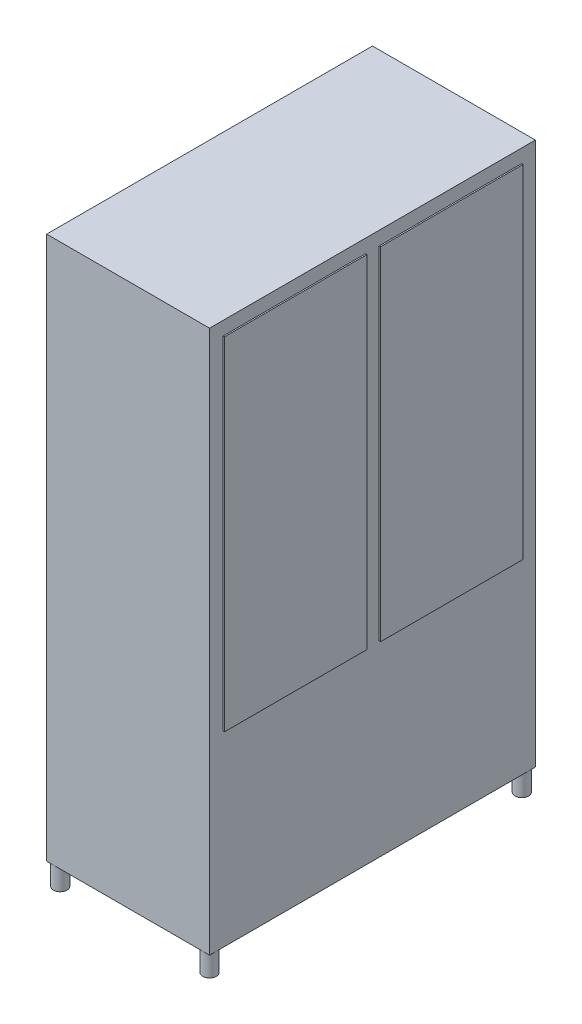
ISO-10303-21;
HEADER;
FILE_DESCRIPTION(('STEP AP214'),'2;1');
FILE_NAME('part.step','',(''),(''),'','','');
FILE_SCHEMA(('AUTOMOTIVE_DESIGN { 1 0 10303 214 1 1 1 1 }'));
ENDSEC;
DATA;
#1=APPLICATION_CONTEXT('core data for automotive mechanical design processes');
#2=APPLICATION_PROTOCOL_DEFINITION('international standard','automotive_design',2000,#1);
#3=PRODUCT_CONTEXT('',#1,'mechanical');
#4=PRODUCT('Part','Part','',(#3));
#5=PRODUCT_RELATED_PRODUCT_CATEGORY('part','',(#4));
#6=PRODUCT_DEFINITION_FORMATION('','',#4);
#7=PRODUCT_DEFINITION_CONTEXT('part definition',#1,'design');
#8=PRODUCT_DEFINITION('design','',#6,#7);
#9=PRODUCT_DEFINITION_SHAPE('','',#8);
#10=(LENGTH_UNIT() NAMED_UNIT(*) SI_UNIT(.MILLI.,.METRE.));
#11=(NAMED_UNIT(*) PLANE_ANGLE_UNIT() SI_UNIT($,.RADIAN.));
#12=(NAMED_UNIT(*) SI_UNIT($,.STERADIAN.) SOLID_ANGLE_UNIT());
#13=UNCERTAINTY_MEASURE_WITH_UNIT(LENGTH_MEASURE(1.E-05),#10,'distance_accuracy_value','');
#14=(GEOMETRIC_REPRESENTATION_CONTEXT(3) GLOBAL_UNCERTAINTY_ASSIGNED_CONTEXT((#13)) GLOBAL_UNIT_ASSIGNED_CONTEXT((#10,
#11,#12)) REPRESENTATION_CONTEXT('',''));
#15=CARTESIAN_POINT('',(0.,0.,0.));
#16=DIRECTION('',(0.,0.,1.));
#17=DIRECTION('',(1.,0.,0.));
#18=AXIS2_PLACEMENT_3D('',#15,#16,#17);
#19=CARTESIAN_POINT('',(300.,2000.,600.));
#20=DIRECTION('',(-1.,0.,0.));
#21=DIRECTION('',(0.,0.,1.));
#22=AXIS2_PLACEMENT_3D('',#19,#20,#21);
#23=PLANE('',#22);
#24=DIRECTION('',(0.,0.,-1.));
#25=VECTOR('',#24,1.);
#26=CARTESIAN_POINT('',(300.,1950.,-550.));
#27=LINE('',#26,#25);
#28=CARTESIAN_POINT('',(300.,1950.,-25.));
#29=VERTEX_POINT('',#28);
#30=CARTESIAN_POINT('',(300.,1950.,-550.));
#31=VERTEX_POINT('',#30);
#32=EDGE_CURVE('E179',#29,#31,#27,.T.);
#33=ORIENTED_EDGE('',*,*,#32,.T.);
#34=DIRECTION('',(0.,-1.,0.));
#35=VECTOR('',#34,1.);
#36=CARTESIAN_POINT('',(300.,1950.,-550.));
#37=LINE('',#36,#35);
#38=CARTESIAN_POINT('',(300.,690.,-550.));
#39=VERTEX_POINT('',#38);
#40=EDGE_CURVE('E153',#31,#39,#37,.T.);
#41=ORIENTED_EDGE('',*,*,#40,.T.);
#42=DIRECTION('',(0.,0.,1.));
#43=VECTOR('',#42,1.);
#44=CARTESIAN_POINT('',(300.,690.,-550.));
#45=LINE('',#44,#43);
#46=CARTESIAN_POINT('',(300.,690.,-24.9999999999999));
#47=VERTEX_POINT('',#46);
#48=EDGE_CURVE('E169',#39,#47,#45,.T.);
#49=ORIENTED_EDGE('',*,*,#48,.T.);
#50=DIRECTION('',(0.,1.,0.));
#51=VECTOR('',#50,1.);
#52=CARTESIAN_POINT('',(300.,1950.,-25.));
#53=LINE('',#52,#51);
#54=EDGE_CURVE('E49',#47,#29,#53,.T.);
#55=ORIENTED_EDGE('',*,*,#54,.T.);
#56=EDGE_LOOP('',(#33,#41,#49,#55));
#57=FACE_BOUND('',#56,.T.);
#58=DIRECTION('',(0.,0.,-1.));
#59=VECTOR('',#58,1.);
#60=CARTESIAN_POINT('',(300.,0.,600.));
#61=LINE('',#60,#59);
#62=CARTESIAN_POINT('',(300.,0.,600.));
#63=VERTEX_POINT('',#62);
#64=CARTESIAN_POINT('',(300.,0.,575.));
#65=VERTEX_POINT('',#64);
#66=EDGE_CURVE('E253',#63,#65,#61,.T.);
#67=ORIENTED_EDGE('',*,*,#66,.T.);
#68=CARTESIAN_POINT('',(300.,0.,-575.));
#69=VERTEX_POINT('',#68);
#70=EDGE_CURVE('E256',#65,#69,#61,.T.);
#71=ORIENTED_EDGE('',*,*,#70,.T.);
#72=CARTESIAN_POINT('',(300.,0.,-600.));
#73=VERTEX_POINT('',#72);
#74=EDGE_CURVE('E238',#69,#73,#61,.T.);
#75=ORIENTED_EDGE('',*,*,#74,.T.);
#76=DIRECTION('',(0.,-1.,0.));
#77=VECTOR('',#76,1.);
#78=CARTESIAN_POINT('',(300.,2000.,-600.));
#79=LINE('',#78,#77);
#80=CARTESIAN_POINT('',(300.,2000.,-600.));
#81=VERTEX_POINT('',#80);
#82=EDGE_CURVE('E276',#81,#73,#79,.T.);
#83=ORIENTED_EDGE('',*,*,#82,.F.);
#84=DIRECTION('',(0.,0.,-1.));
#85=VECTOR('',#84,1.);
#86=CARTESIAN_POINT('',(300.,2000.,600.));
#87=LINE('',#86,#85);
#88=CARTESIAN_POINT('',(300.,2000.,600.));
#89=VERTEX_POINT('',#88);
#90=EDGE_CURVE('E242',#89,#81,#87,.T.);
#91=ORIENTED_EDGE('',*,*,#90,.F.);
#92=DIRECTION('',(0.,-1.,0.));
#93=VECTOR('',#92,1.);
#94=CARTESIAN_POINT('',(300.,2000.,600.));
#95=LINE('',#94,#93);
#96=EDGE_CURVE('E252',#89,#63,#95,.T.);
#97=ORIENTED_EDGE('',*,*,#96,.T.);
#98=EDGE_LOOP('',(#67,#71,#75,#83,#91,#97));
#99=FACE_BOUND('',#98,.T.);
#100=DIRECTION('',(0.,-1.,0.));
#101=VECTOR('',#100,1.);
#102=CARTESIAN_POINT('',(300.,1950.,550.));
#103=LINE('',#102,#101);
#104=CARTESIAN_POINT('',(300.,1950.,550.));
#105=VERTEX_POINT('',#104);
#106=CARTESIAN_POINT('',(300.,690.,550.));
#107=VERTEX_POINT('',#106);
#108=EDGE_CURVE('E158',#105,#107,#103,.T.);
#109=ORIENTED_EDGE('',*,*,#108,.F.);
#110=DIRECTION('',(0.,0.,1.));
#111=VECTOR('',#110,1.);
#112=CARTESIAN_POINT('',(300.,1950.,550.));
#113=LINE('',#112,#111);
#114=CARTESIAN_POINT('',(300.,1950.,25.));
#115=VERTEX_POINT('',#114);
#116=EDGE_CURVE('E192',#115,#105,#113,.T.);
#117=ORIENTED_EDGE('',*,*,#116,.F.);
#118=DIRECTION('',(0.,1.,0.));
#119=VECTOR('',#118,1.);
#120=CARTESIAN_POINT('',(300.,1950.,25.));
#121=LINE('',#120,#119);
#122=CARTESIAN_POINT('',(300.,690.,24.9999999999999));
#123=VERTEX_POINT('',#122);
#124=EDGE_CURVE('E202',#123,#115,#121,.T.);
#125=ORIENTED_EDGE('',*,*,#124,.F.);
#126=DIRECTION('',(0.,0.,-1.));
#127=VECTOR('',#126,1.);
#128=CARTESIAN_POINT('',(300.,690.,550.));
#129=LINE('',#128,#127);
#130=EDGE_CURVE('E57',#107,#123,#129,.T.);
#131=ORIENTED_EDGE('',*,*,#130,.F.);
#132=EDGE_LOOP('',(#109,#117,#125,#131));
#133=FACE_BOUND('',#132,.T.);
#134=ADVANCED_FACE('F35',(#57,#99,#133),#23,.F.);
#135=CARTESIAN_POINT('',(0.,0.,0.));
#136=DIRECTION('',(0.,-1.,0.));
#137=DIRECTION('',(0.,0.,-1.));
#138=AXIS2_PLACEMENT_3D('',#135,#136,#137);
#139=PLANE('',#138);
#140=DIRECTION('',(-1.,0.,0.));
#141=VECTOR('',#140,1.);
#142=CARTESIAN_POINT('',(-300.,0.,-600.));
#143=LINE('',#142,#141);
#144=CARTESIAN_POINT('',(-275.,0.,-600.));
#145=VERTEX_POINT('',#144);
#146=CARTESIAN_POINT('',(-300.,0.,-600.));
#147=VERTEX_POINT('',#146);
#148=EDGE_CURVE('E255',#145,#147,#143,.T.);
#149=ORIENTED_EDGE('',*,*,#148,.F.);
#150=CARTESIAN_POINT('',(-275.,0.,-575.));
#151=DIRECTION('',(0.,-1.,0.));
#152=DIRECTION('',(0.,0.,1.));
#153=AXIS2_PLACEMENT_3D('',#150,#151,#152);
#154=CIRCLE('',#153,25.);
#155=CARTESIAN_POINT('',(-300.,0.,-575.));
#156=VERTEX_POINT('',#155);
#157=EDGE_CURVE('E217',#156,#145,#154,.T.);
#158=ORIENTED_EDGE('',*,*,#157,.F.);
#159=DIRECTION('',(0.,0.,1.));
#160=VECTOR('',#159,1.);
#161=CARTESIAN_POINT('',(-300.,0.,600.));
#162=LINE('',#161,#160);
#163=EDGE_CURVE('E261',#147,#156,#162,.T.);
#164=ORIENTED_EDGE('',*,*,#163,.F.);
#165=EDGE_LOOP('',(#149,#158,#164));
#166=FACE_BOUND('',#165,.T.);
#167=ADVANCED_FACE('F333',(#166),#139,.T.);
#168=CARTESIAN_POINT('',(-300.,0.,575.));
#169=VERTEX_POINT('',#168);
#170=EDGE_CURVE('E265',#156,#169,#162,.T.);
#171=ORIENTED_EDGE('',*,*,#170,.F.);
#172=CARTESIAN_POINT('',(-275.,0.,-575.));
#173=DIRECTION('',(0.,-1.,0.));
#174=DIRECTION('',(0.,0.,-1.));
#175=AXIS2_PLACEMENT_3D('',#172,#173,#174);
#176=CIRCLE('',#175,25.);
#177=EDGE_CURVE('E11',#156,#145,#176,.F.);
#178=ORIENTED_EDGE('',*,*,#177,.T.);
#179=CARTESIAN_POINT('',(275.,0.,-600.));
#180=VERTEX_POINT('',#179);
#181=EDGE_CURVE('E260',#180,#145,#143,.T.);
#182=ORIENTED_EDGE('',*,*,#181,.F.);
#183=CARTESIAN_POINT('',(275.,0.,-575.));
#184=DIRECTION('',(0.,-1.,0.));
#185=DIRECTION('',(0.,0.,-1.));
#186=AXIS2_PLACEMENT_3D('',#183,#184,#185);
#187=CIRCLE('',#186,25.);
#188=EDGE_CURVE('E42',#69,#180,#187,.T.);
#189=ORIENTED_EDGE('',*,*,#188,.F.);
#190=ORIENTED_EDGE('',*,*,#70,.F.);
#191=CARTESIAN_POINT('',(275.,0.,575.));
#192=DIRECTION('',(0.,-1.,0.));
#193=DIRECTION('',(0.,0.,-1.));
#194=AXIS2_PLACEMENT_3D('',#191,#192,#193);
#195=CIRCLE('',#194,25.);
#196=CARTESIAN_POINT('',(275.,0.,600.));
#197=VERTEX_POINT('',#196);
#198=EDGE_CURVE('E241',#197,#65,#195,.T.);
#199=ORIENTED_EDGE('',*,*,#198,.F.);
#200=DIRECTION('',(1.,0.,0.));
#201=VECTOR('',#200,1.);
#202=CARTESIAN_POINT('',(-300.,0.,600.));
#203=LINE('',#202,#201);
#204=CARTESIAN_POINT('',(-275.,0.,600.));
#205=VERTEX_POINT('',#204);
#206=EDGE_CURVE('E267',#205,#197,#203,.T.);
#207=ORIENTED_EDGE('',*,*,#206,.F.);
#208=CARTESIAN_POINT('',(-275.,0.,575.));
#209=DIRECTION('',(0.,-1.,0.));
#210=DIRECTION('',(0.,0.,-1.));
#211=AXIS2_PLACEMENT_3D('',#208,#209,#210);
#212=CIRCLE('',#211,25.);
#213=EDGE_CURVE('E279',#169,#205,#212,.T.);
#214=ORIENTED_EDGE('',*,*,#213,.F.);
#215=EDGE_LOOP('',(#171,#178,#182,#189,#190,#199,#207,#214));
#216=FACE_BOUND('',#215,.T.);
#217=ADVANCED_FACE('F290',(#216),#139,.T.);
#218=CARTESIAN_POINT('',(275.,0.,-575.));
#219=DIRECTION('',(0.,1.,0.));
#220=DIRECTION('',(0.,0.,1.));
#221=AXIS2_PLACEMENT_3D('',#218,#219,#220);
#222=CIRCLE('',#221,25.);
#223=EDGE_CURVE('E221',#69,#180,#222,.T.);
#224=ORIENTED_EDGE('',*,*,#223,.T.);
#225=EDGE_CURVE('E257',#73,#180,#143,.T.);
#226=ORIENTED_EDGE('',*,*,#225,.F.);
#227=ORIENTED_EDGE('',*,*,#74,.F.);
#228=EDGE_LOOP('',(#224,#226,#227));
#229=FACE_BOUND('',#228,.T.);
#230=ADVANCED_FACE('F297',(#229),#139,.T.);
#231=CARTESIAN_POINT('',(-275.,0.,575.));
#232=DIRECTION('',(0.,1.,0.));
#233=DIRECTION('',(0.,0.,-1.));
#234=AXIS2_PLACEMENT_3D('',#231,#232,#233);
#235=CIRCLE('',#234,25.);
#236=EDGE_CURVE('E226',#169,#205,#235,.T.);
#237=ORIENTED_EDGE('',*,*,#236,.T.);
#238=CARTESIAN_POINT('',(-300.,0.,600.));
#239=VERTEX_POINT('',#238);
#240=EDGE_CURVE('E246',#239,#205,#203,.T.);
#241=ORIENTED_EDGE('',*,*,#240,.F.);
#242=EDGE_CURVE('E259',#169,#239,#162,.T.);
#243=ORIENTED_EDGE('',*,*,#242,.F.);
#244=EDGE_LOOP('',(#237,#241,#243));
#245=FACE_BOUND('',#244,.T.);
#246=ADVANCED_FACE('F316',(#245),#139,.T.);
#247=EDGE_CURVE('E232',#65,#197,#195,.T.);
#248=ORIENTED_EDGE('',*,*,#247,.F.);
#249=ORIENTED_EDGE('',*,*,#66,.F.);
#250=EDGE_CURVE('E264',#197,#63,#203,.T.);
#251=ORIENTED_EDGE('',*,*,#250,.F.);
#252=EDGE_LOOP('',(#248,#249,#251));
#253=FACE_BOUND('',#252,.T.);
#254=ADVANCED_FACE('F305',(#253),#139,.T.);
#255=CARTESIAN_POINT('',(-300.,2000.,-600.));
#256=DIRECTION('',(0.,0.,1.));
#257=DIRECTION('',(1.,0.,0.));
#258=AXIS2_PLACEMENT_3D('',#255,#256,#257);
#259=PLANE('',#258);
#260=ORIENTED_EDGE('',*,*,#225,.T.);
#261=ORIENTED_EDGE('',*,*,#181,.T.);
#262=ORIENTED_EDGE('',*,*,#148,.T.);
#263=DIRECTION('',(0.,-1.,0.));
#264=VECTOR('',#263,1.);
#265=CARTESIAN_POINT('',(-300.,2000.,-600.));
#266=LINE('',#265,#264);
#267=CARTESIAN_POINT('',(-300.,2000.,-600.));
#268=VERTEX_POINT('',#267);
#269=EDGE_CURVE('E273',#268,#147,#266,.T.);
#270=ORIENTED_EDGE('',*,*,#269,.F.);
#271=DIRECTION('',(-1.,0.,0.));
#272=VECTOR('',#271,1.);
#273=CARTESIAN_POINT('',(-300.,2000.,-600.));
#274=LINE('',#273,#272);
#275=EDGE_CURVE('E245',#81,#268,#274,.T.);
#276=ORIENTED_EDGE('',*,*,#275,.F.);
#277=ORIENTED_EDGE('',*,*,#82,.T.);
#278=EDGE_LOOP('',(#260,#261,#262,#270,#276,#277));
#279=FACE_BOUND('',#278,.T.);
#280=ADVANCED_FACE('F534',(#279),#259,.F.);
#281=CARTESIAN_POINT('',(-300.,2000.,600.));
#282=DIRECTION('',(1.,0.,0.));
#283=DIRECTION('',(0.,0.,-1.));
#284=AXIS2_PLACEMENT_3D('',#281,#282,#283);
#285=PLANE('',#284);
#286=ORIENTED_EDGE('',*,*,#163,.T.);
#287=ORIENTED_EDGE('',*,*,#170,.T.);
#288=ORIENTED_EDGE('',*,*,#242,.T.);
#289=DIRECTION('',(0.,-1.,0.));
#290=VECTOR('',#289,1.);
#291=CARTESIAN_POINT('',(-300.,2000.,600.));
#292=LINE('',#291,#290);
#293=CARTESIAN_POINT('',(-300.,2000.,600.));
#294=VERTEX_POINT('',#293);
#295=EDGE_CURVE('E270',#294,#239,#292,.T.);
#296=ORIENTED_EDGE('',*,*,#295,.F.);
#297=DIRECTION('',(0.,0.,1.));
#298=VECTOR('',#297,1.);
#299=CARTESIAN_POINT('',(-300.,2000.,600.));
#300=LINE('',#299,#298);
#301=EDGE_CURVE('E248',#268,#294,#300,.T.);
#302=ORIENTED_EDGE('',*,*,#301,.F.);
#303=ORIENTED_EDGE('',*,*,#269,.T.);
#304=EDGE_LOOP('',(#286,#287,#288,#296,#302,#303));
#305=FACE_BOUND('',#304,.T.);
#306=ADVANCED_FACE('F549',(#305),#285,.F.);
#307=CARTESIAN_POINT('',(-300.,2000.,600.));
#308=DIRECTION('',(0.,0.,-1.));
#309=DIRECTION('',(-1.,0.,0.));
#310=AXIS2_PLACEMENT_3D('',#307,#308,#309);
#311=PLANE('',#310);
#312=ORIENTED_EDGE('',*,*,#240,.T.);
#313=ORIENTED_EDGE('',*,*,#206,.T.);
#314=ORIENTED_EDGE('',*,*,#250,.T.);
#315=ORIENTED_EDGE('',*,*,#96,.F.);
#316=DIRECTION('',(1.,0.,0.));
#317=VECTOR('',#316,1.);
#318=CARTESIAN_POINT('',(-300.,2000.,600.));
#319=LINE('',#318,#317);
#320=EDGE_CURVE('E250',#294,#89,#319,.T.);
#321=ORIENTED_EDGE('',*,*,#320,.F.);
#322=ORIENTED_EDGE('',*,*,#295,.T.);
#323=EDGE_LOOP('',(#312,#313,#314,#315,#321,#322));
#324=FACE_BOUND('',#323,.T.);
#325=ADVANCED_FACE('F541',(#324),#311,.F.);
#326=CARTESIAN_POINT('',(0.,2000.,0.));
#327=DIRECTION('',(0.,-1.,0.));
#328=DIRECTION('',(0.,0.,-1.));
#329=AXIS2_PLACEMENT_3D('',#326,#327,#328);
#330=PLANE('',#329);
#331=ORIENTED_EDGE('',*,*,#90,.T.);
#332=ORIENTED_EDGE('',*,*,#275,.T.);
#333=ORIENTED_EDGE('',*,*,#301,.T.);
#334=ORIENTED_EDGE('',*,*,#320,.T.);
#335=EDGE_LOOP('',(#331,#332,#333,#334));
#336=FACE_BOUND('',#335,.T.);
#337=ADVANCED_FACE('F525',(#336),#330,.F.);
#338=CARTESIAN_POINT('',(275.,-80.,575.));
#339=DIRECTION('',(0.,1.,0.));
#340=DIRECTION('',(0.,0.,1.));
#341=AXIS2_PLACEMENT_3D('',#338,#339,#340);
#342=CYLINDRICAL_SURFACE('',#341,25.);
#343=CARTESIAN_POINT('',(275.,-80.,575.));
#344=DIRECTION('',(0.,-1.,0.));
#345=DIRECTION('',(0.,0.,-1.));
#346=AXIS2_PLACEMENT_3D('',#343,#344,#345);
#347=CIRCLE('',#346,25.);
#348=CARTESIAN_POINT('',(275.,-80.,550.));
#349=VERTEX_POINT('',#348);
#350=EDGE_CURVE('E235',#349,#349,#347,.T.);
#351=ORIENTED_EDGE('',*,*,#350,.F.);
#352=EDGE_LOOP('',(#351));
#353=FACE_BOUND('',#352,.T.);
#354=ORIENTED_EDGE('',*,*,#247,.T.);
#355=ORIENTED_EDGE('',*,*,#198,.T.);
#356=EDGE_LOOP('',(#354,#355));
#357=FACE_BOUND('',#356,.T.);
#358=ADVANCED_FACE('F308',(#353,#357),#342,.T.);
#359=CARTESIAN_POINT('',(275.,-80.,575.));
#360=DIRECTION('',(0.,-1.,0.));
#361=DIRECTION('',(0.,0.,-1.));
#362=AXIS2_PLACEMENT_3D('',#359,#360,#361);
#363=PLANE('',#362);
#364=ORIENTED_EDGE('',*,*,#350,.T.);
#365=EDGE_LOOP('',(#364));
#366=FACE_BOUND('',#365,.T.);
#367=ADVANCED_FACE('F321',(#366),#363,.T.);
#368=CARTESIAN_POINT('',(-275.,-80.,575.));
#369=DIRECTION('',(0.,1.,0.));
#370=DIRECTION('',(0.,0.,1.));
#371=AXIS2_PLACEMENT_3D('',#368,#369,#370);
#372=CYLINDRICAL_SURFACE('',#371,25.);
#373=CARTESIAN_POINT('',(-275.,-80.,575.));
#374=DIRECTION('',(0.,1.,0.));
#375=DIRECTION('',(0.,0.,-1.));
#376=AXIS2_PLACEMENT_3D('',#373,#374,#375);
#377=CIRCLE('',#376,25.);
#378=CARTESIAN_POINT('',(-275.,-80.,550.));
#379=VERTEX_POINT('',#378);
#380=EDGE_CURVE('E229',#379,#379,#377,.T.);
#381=ORIENTED_EDGE('',*,*,#380,.T.);
#382=EDGE_LOOP('',(#381));
#383=FACE_BOUND('',#382,.T.);
#384=ORIENTED_EDGE('',*,*,#236,.F.);
#385=ORIENTED_EDGE('',*,*,#213,.T.);
#386=EDGE_LOOP('',(#384,#385));
#387=FACE_BOUND('',#386,.T.);
#388=ADVANCED_FACE('F318',(#383,#387),#372,.T.);
#389=CARTESIAN_POINT('',(-275.,-80.,575.));
#390=DIRECTION('',(0.,-1.,0.));
#391=DIRECTION('',(0.,0.,-1.));
#392=AXIS2_PLACEMENT_3D('',#389,#390,#391);
#393=PLANE('',#392);
#394=ORIENTED_EDGE('',*,*,#380,.F.);
#395=EDGE_LOOP('',(#394));
#396=FACE_BOUND('',#395,.T.);
#397=ADVANCED_FACE('F320',(#396),#393,.T.);
#398=CARTESIAN_POINT('',(275.,-80.,-575.));
#399=DIRECTION('',(0.,1.,0.));
#400=DIRECTION('',(0.,0.,1.));
#401=AXIS2_PLACEMENT_3D('',#398,#399,#400);
#402=CYLINDRICAL_SURFACE('',#401,25.);
#403=CARTESIAN_POINT('',(275.,-80.,-575.));
#404=DIRECTION('',(0.,1.,0.));
#405=DIRECTION('',(0.,0.,1.));
#406=AXIS2_PLACEMENT_3D('',#403,#404,#405);
#407=CIRCLE('',#406,25.);
#408=CARTESIAN_POINT('',(275.,-80.,-550.));
#409=VERTEX_POINT('',#408);
#410=EDGE_CURVE('E223',#409,#409,#407,.T.);
#411=ORIENTED_EDGE('',*,*,#410,.T.);
#412=EDGE_LOOP('',(#411));
#413=FACE_BOUND('',#412,.T.);
#414=ORIENTED_EDGE('',*,*,#223,.F.);
#415=ORIENTED_EDGE('',*,*,#188,.T.);
#416=EDGE_LOOP('',(#414,#415));
#417=FACE_BOUND('',#416,.T.);
#418=ADVANCED_FACE('F284',(#413,#417),#402,.T.);
#419=CARTESIAN_POINT('',(275.,-80.,-575.));
#420=DIRECTION('',(0.,-1.,0.));
#421=DIRECTION('',(0.,0.,1.));
#422=AXIS2_PLACEMENT_3D('',#419,#420,#421);
#423=PLANE('',#422);
#424=ORIENTED_EDGE('',*,*,#410,.F.);
#425=EDGE_LOOP('',(#424));
#426=FACE_BOUND('',#425,.T.);
#427=ADVANCED_FACE('F383',(#426),#423,.T.);
#428=CARTESIAN_POINT('',(-275.,-80.,-575.));
#429=DIRECTION('',(0.,1.,0.));
#430=DIRECTION('',(0.,0.,1.));
#431=AXIS2_PLACEMENT_3D('',#428,#429,#430);
#432=CYLINDRICAL_SURFACE('',#431,25.);
#433=CARTESIAN_POINT('',(-275.,-80.,-575.));
#434=DIRECTION('',(0.,-1.,0.));
#435=DIRECTION('',(0.,0.,1.));
#436=AXIS2_PLACEMENT_3D('',#433,#434,#435);
#437=CIRCLE('',#436,25.);
#438=CARTESIAN_POINT('',(-275.,-80.,-550.));
#439=VERTEX_POINT('',#438);
#440=EDGE_CURVE('E218',#439,#439,#437,.T.);
#441=ORIENTED_EDGE('',*,*,#440,.F.);
#442=EDGE_LOOP('',(#441));
#443=FACE_BOUND('',#442,.T.);
#444=ORIENTED_EDGE('',*,*,#157,.T.);
#445=ORIENTED_EDGE('',*,*,#177,.F.);
#446=EDGE_LOOP('',(#444,#445));
#447=FACE_BOUND('',#446,.T.);
#448=ADVANCED_FACE('F379',(#443,#447),#432,.T.);
#449=CARTESIAN_POINT('',(-275.,-80.,-575.));
#450=DIRECTION('',(0.,-1.,0.));
#451=DIRECTION('',(0.,0.,1.));
#452=AXIS2_PLACEMENT_3D('',#449,#450,#451);
#453=PLANE('',#452);
#454=ORIENTED_EDGE('',*,*,#440,.T.);
#455=EDGE_LOOP('',(#454));
#456=FACE_BOUND('',#455,.T.);
#457=ADVANCED_FACE('F375',(#456),#453,.T.);
#458=CARTESIAN_POINT('',(305.,1950.,550.));
#459=DIRECTION('',(0.,0.,-1.));
#460=DIRECTION('',(-1.,0.,0.));
#461=AXIS2_PLACEMENT_3D('',#458,#459,#460);
#462=PLANE('',#461);
#463=ORIENTED_EDGE('',*,*,#108,.T.);
#464=DIRECTION('',(-1.,0.,0.));
#465=VECTOR('',#464,1.);
#466=CARTESIAN_POINT('',(305.,690.,550.));
#467=LINE('',#466,#465);
#468=CARTESIAN_POINT('',(305.,690.,550.));
#469=VERTEX_POINT('',#468);
#470=EDGE_CURVE('E215',#469,#107,#467,.T.);
#471=ORIENTED_EDGE('',*,*,#470,.F.);
#472=DIRECTION('',(0.,-1.,0.));
#473=VECTOR('',#472,1.);
#474=CARTESIAN_POINT('',(305.,1950.,550.));
#475=LINE('',#474,#473);
#476=CARTESIAN_POINT('',(305.,1950.,550.));
#477=VERTEX_POINT('',#476);
#478=EDGE_CURVE('E188',#477,#469,#475,.T.);
#479=ORIENTED_EDGE('',*,*,#478,.F.);
#480=DIRECTION('',(-1.,0.,0.));
#481=VECTOR('',#480,1.);
#482=CARTESIAN_POINT('',(305.,1950.,550.));
#483=LINE('',#482,#481);
#484=EDGE_CURVE('E198',#477,#105,#483,.T.);
#485=ORIENTED_EDGE('',*,*,#484,.T.);
#486=EDGE_LOOP('',(#463,#471,#479,#485));
#487=FACE_BOUND('',#486,.T.);
#488=ADVANCED_FACE('F371',(#487),#462,.F.);
#489=CARTESIAN_POINT('',(305.,690.,550.));
#490=DIRECTION('',(0.,1.,0.));
#491=DIRECTION('',(0.,0.,1.));
#492=AXIS2_PLACEMENT_3D('',#489,#490,#491);
#493=PLANE('',#492);
#494=ORIENTED_EDGE('',*,*,#130,.T.);
#495=DIRECTION('',(-1.,0.,0.));
#496=VECTOR('',#495,1.);
#497=CARTESIAN_POINT('',(305.,690.,24.9999999999999));
#498=LINE('',#497,#496);
#499=CARTESIAN_POINT('',(305.,690.,24.9999999999999));
#500=VERTEX_POINT('',#499);
#501=EDGE_CURVE('E212',#500,#123,#498,.T.);
#502=ORIENTED_EDGE('',*,*,#501,.F.);
#503=DIRECTION('',(0.,0.,-1.));
#504=VECTOR('',#503,1.);
#505=CARTESIAN_POINT('',(305.,690.,550.));
#506=LINE('',#505,#504);
#507=EDGE_CURVE('E191',#469,#500,#506,.T.);
#508=ORIENTED_EDGE('',*,*,#507,.F.);
#509=ORIENTED_EDGE('',*,*,#470,.T.);
#510=EDGE_LOOP('',(#494,#502,#508,#509));
#511=FACE_BOUND('',#510,.T.);
#512=ADVANCED_FACE('F367',(#511),#493,.F.);
#513=CARTESIAN_POINT('',(305.,1950.,25.));
#514=DIRECTION('',(0.,0.,1.));
#515=DIRECTION('',(0.,-1.,0.));
#516=AXIS2_PLACEMENT_3D('',#513,#514,#515);
#517=PLANE('',#516);
#518=ORIENTED_EDGE('',*,*,#124,.T.);
#519=DIRECTION('',(-1.,0.,0.));
#520=VECTOR('',#519,1.);
#521=CARTESIAN_POINT('',(305.,1950.,25.));
#522=LINE('',#521,#520);
#523=CARTESIAN_POINT('',(305.,1950.,25.));
#524=VERTEX_POINT('',#523);
#525=EDGE_CURVE('E209',#524,#115,#522,.T.);
#526=ORIENTED_EDGE('',*,*,#525,.F.);
#527=DIRECTION('',(0.,1.,0.));
#528=VECTOR('',#527,1.);
#529=CARTESIAN_POINT('',(305.,1950.,25.));
#530=LINE('',#529,#528);
#531=EDGE_CURVE('E194',#500,#524,#530,.T.);
#532=ORIENTED_EDGE('',*,*,#531,.F.);
#533=ORIENTED_EDGE('',*,*,#501,.T.);
#534=EDGE_LOOP('',(#518,#526,#532,#533));
#535=FACE_BOUND('',#534,.T.);
#536=ADVANCED_FACE('F363',(#535),#517,.F.);
#537=CARTESIAN_POINT('',(305.,1950.,550.));
#538=DIRECTION('',(0.,-1.,0.));
#539=DIRECTION('',(0.,0.,-1.));
#540=AXIS2_PLACEMENT_3D('',#537,#538,#539);
#541=PLANE('',#540);
#542=ORIENTED_EDGE('',*,*,#116,.T.);
#543=ORIENTED_EDGE('',*,*,#484,.F.);
#544=DIRECTION('',(0.,0.,1.));
#545=VECTOR('',#544,1.);
#546=CARTESIAN_POINT('',(305.,1950.,550.));
#547=LINE('',#546,#545);
#548=EDGE_CURVE('E196',#524,#477,#547,.T.);
#549=ORIENTED_EDGE('',*,*,#548,.F.);
#550=ORIENTED_EDGE('',*,*,#525,.T.);
#551=EDGE_LOOP('',(#542,#543,#549,#550));
#552=FACE_BOUND('',#551,.T.);
#553=ADVANCED_FACE('F359',(#552),#541,.F.);
#554=CARTESIAN_POINT('',(305.,0.,0.));
#555=DIRECTION('',(1.,0.,0.));
#556=DIRECTION('',(0.,0.,-1.));
#557=AXIS2_PLACEMENT_3D('',#554,#555,#556);
#558=PLANE('',#557);
#559=ORIENTED_EDGE('',*,*,#478,.T.);
#560=ORIENTED_EDGE('',*,*,#507,.T.);
#561=ORIENTED_EDGE('',*,*,#531,.T.);
#562=ORIENTED_EDGE('',*,*,#548,.T.);
#563=EDGE_LOOP('',(#559,#560,#561,#562));
#564=FACE_BOUND('',#563,.T.);
#565=ADVANCED_FACE('F356',(#564),#558,.T.);
#566=CARTESIAN_POINT('',(305.,1950.,-550.));
#567=DIRECTION('',(0.,0.,-1.));
#568=DIRECTION('',(-1.,0.,0.));
#569=AXIS2_PLACEMENT_3D('',#566,#567,#568);
#570=PLANE('',#569);
#571=ORIENTED_EDGE('',*,*,#40,.F.);
#572=DIRECTION('',(-1.,0.,0.));
#573=VECTOR('',#572,1.);
#574=CARTESIAN_POINT('',(305.,1950.,-550.));
#575=LINE('',#574,#573);
#576=CARTESIAN_POINT('',(305.,1950.,-550.));
#577=VERTEX_POINT('',#576);
#578=EDGE_CURVE('E147',#577,#31,#575,.T.);
#579=ORIENTED_EDGE('',*,*,#578,.F.);
#580=DIRECTION('',(0.,-1.,0.));
#581=VECTOR('',#580,1.);
#582=CARTESIAN_POINT('',(305.,1950.,-550.));
#583=LINE('',#582,#581);
#584=CARTESIAN_POINT('',(305.,690.,-550.));
#585=VERTEX_POINT('',#584);
#586=EDGE_CURVE('E150',#577,#585,#583,.T.);
#587=ORIENTED_EDGE('',*,*,#586,.T.);
#588=DIRECTION('',(-1.,0.,0.));
#589=VECTOR('',#588,1.);
#590=CARTESIAN_POINT('',(305.,690.,-550.));
#591=LINE('',#590,#589);
#592=EDGE_CURVE('E177',#585,#39,#591,.T.);
#593=ORIENTED_EDGE('',*,*,#592,.T.);
#594=EDGE_LOOP('',(#571,#579,#587,#593));
#595=FACE_BOUND('',#594,.T.);
#596=ADVANCED_FACE('F149',(#595),#570,.T.);
#597=CARTESIAN_POINT('',(305.,1950.,-550.));
#598=DIRECTION('',(0.,1.,0.));
#599=DIRECTION('',(0.,0.,1.));
#600=AXIS2_PLACEMENT_3D('',#597,#598,#599);
#601=PLANE('',#600);
#602=ORIENTED_EDGE('',*,*,#32,.F.);
#603=DIRECTION('',(-1.,0.,0.));
#604=VECTOR('',#603,1.);
#605=CARTESIAN_POINT('',(305.,1950.,-25.));
#606=LINE('',#605,#604);
#607=CARTESIAN_POINT('',(305.,1950.,-25.));
#608=VERTEX_POINT('',#607);
#609=EDGE_CURVE('E159',#608,#29,#606,.T.);
#610=ORIENTED_EDGE('',*,*,#609,.F.);
#611=DIRECTION('',(0.,0.,-1.));
#612=VECTOR('',#611,1.);
#613=CARTESIAN_POINT('',(305.,1950.,-550.));
#614=LINE('',#613,#612);
#615=EDGE_CURVE('E165',#608,#577,#614,.T.);
#616=ORIENTED_EDGE('',*,*,#615,.T.);
#617=ORIENTED_EDGE('',*,*,#578,.T.);
#618=EDGE_LOOP('',(#602,#610,#616,#617));
#619=FACE_BOUND('',#618,.T.);
#620=ADVANCED_FACE('F171',(#619),#601,.T.);
#621=CARTESIAN_POINT('',(305.,1950.,-25.));
#622=DIRECTION('',(0.,0.,1.));
#623=DIRECTION('',(0.,-1.,0.));
#624=AXIS2_PLACEMENT_3D('',#621,#622,#623);
#625=PLANE('',#624);
#626=ORIENTED_EDGE('',*,*,#54,.F.);
#627=DIRECTION('',(-1.,0.,0.));
#628=VECTOR('',#627,1.);
#629=CARTESIAN_POINT('',(305.,690.,-24.9999999999999));
#630=LINE('',#629,#628);
#631=CARTESIAN_POINT('',(305.,690.,-24.9999999999999));
#632=VERTEX_POINT('',#631);
#633=EDGE_CURVE('E185',#632,#47,#630,.T.);
#634=ORIENTED_EDGE('',*,*,#633,.F.);
#635=DIRECTION('',(0.,1.,0.));
#636=VECTOR('',#635,1.);
#637=CARTESIAN_POINT('',(305.,1950.,-25.));
#638=LINE('',#637,#636);
#639=EDGE_CURVE('E172',#632,#608,#638,.T.);
#640=ORIENTED_EDGE('',*,*,#639,.T.);
#641=ORIENTED_EDGE('',*,*,#609,.T.);
#642=EDGE_LOOP('',(#626,#634,#640,#641));
#643=FACE_BOUND('',#642,.T.);
#644=ADVANCED_FACE('F343',(#643),#625,.T.);
#645=CARTESIAN_POINT('',(305.,690.,-550.));
#646=DIRECTION('',(0.,-1.,0.));
#647=DIRECTION('',(0.,0.,-1.));
#648=AXIS2_PLACEMENT_3D('',#645,#646,#647);
#649=PLANE('',#648);
#650=ORIENTED_EDGE('',*,*,#48,.F.);
#651=ORIENTED_EDGE('',*,*,#592,.F.);
#652=DIRECTION('',(0.,0.,1.));
#653=VECTOR('',#652,1.);
#654=CARTESIAN_POINT('',(305.,690.,-550.));
#655=LINE('',#654,#653);
#656=EDGE_CURVE('E168',#585,#632,#655,.T.);
#657=ORIENTED_EDGE('',*,*,#656,.T.);
#658=ORIENTED_EDGE('',*,*,#633,.T.);
#659=EDGE_LOOP('',(#650,#651,#657,#658));
#660=FACE_BOUND('',#659,.T.);
#661=ADVANCED_FACE('F342',(#660),#649,.T.);
#662=CARTESIAN_POINT('',(305.,0.,0.));
#663=DIRECTION('',(1.,0.,0.));
#664=DIRECTION('',(0.,0.,1.));
#665=AXIS2_PLACEMENT_3D('',#662,#663,#664);
#666=PLANE('',#665);
#667=ORIENTED_EDGE('',*,*,#586,.F.);
#668=ORIENTED_EDGE('',*,*,#615,.F.);
#669=ORIENTED_EDGE('',*,*,#639,.F.);
#670=ORIENTED_EDGE('',*,*,#656,.F.);
#671=EDGE_LOOP('',(#667,#668,#669,#670));
#672=FACE_BOUND('',#671,.T.);
#673=ADVANCED_FACE('F163',(#672),#666,.T.);
#674=CLOSED_SHELL('',(#134,#167,#217,#230,#246,#254,#280,#306,#325,#337,#358,#367,#388,#397,
#418,#427,#448,#457,#488,#512,#536,#553,#565,#596,#620,#644,#661,#673));
#675=MANIFOLD_SOLID_BREP('B2',#674);
#676=ADVANCED_BREP_SHAPE_REPRESENTATION('',(#18,#675),#14);
#677=SHAPE_DEFINITION_REPRESENTATION(#9,#676);
ENDSEC;
END-ISO-10303-21;
